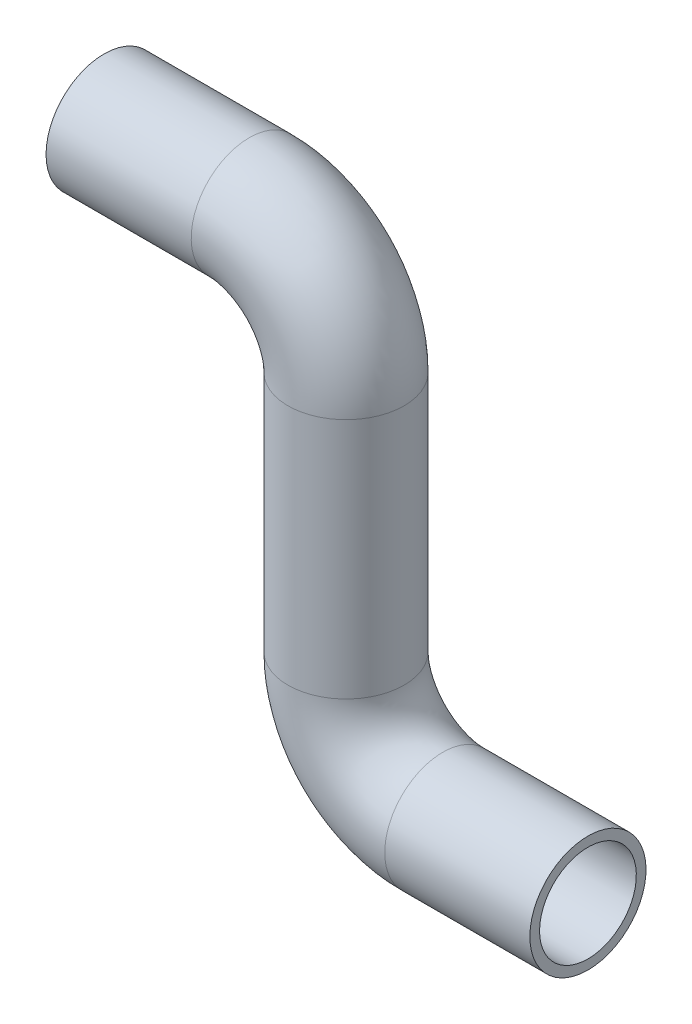
ISO-10303-21;
HEADER;
FILE_DESCRIPTION(('STEP AP214'),'2;1');
FILE_NAME('part.step','',(''),(''),'','','');
FILE_SCHEMA(('AUTOMOTIVE_DESIGN { 1 0 10303 214 1 1 1 1 }'));
ENDSEC;
DATA;
#1=APPLICATION_CONTEXT('core data for automotive mechanical design processes');
#2=APPLICATION_PROTOCOL_DEFINITION('international standard','automotive_design',2000,#1);
#3=PRODUCT_CONTEXT('',#1,'mechanical');
#4=PRODUCT('Part','Part','',(#3));
#5=PRODUCT_RELATED_PRODUCT_CATEGORY('part','',(#4));
#6=PRODUCT_DEFINITION_FORMATION('','',#4);
#7=PRODUCT_DEFINITION_CONTEXT('part definition',#1,'design');
#8=PRODUCT_DEFINITION('design','',#6,#7);
#9=PRODUCT_DEFINITION_SHAPE('','',#8);
#10=(LENGTH_UNIT() NAMED_UNIT(*) SI_UNIT(.MILLI.,.METRE.));
#11=(NAMED_UNIT(*) PLANE_ANGLE_UNIT() SI_UNIT($,.RADIAN.));
#12=(NAMED_UNIT(*) SI_UNIT($,.STERADIAN.) SOLID_ANGLE_UNIT());
#13=UNCERTAINTY_MEASURE_WITH_UNIT(LENGTH_MEASURE(1.E-05),#10,'distance_accuracy_value','');
#14=(GEOMETRIC_REPRESENTATION_CONTEXT(3) GLOBAL_UNCERTAINTY_ASSIGNED_CONTEXT((#13)) GLOBAL_UNIT_ASSIGNED_CONTEXT((#10,
#11,#12)) REPRESENTATION_CONTEXT('',''));
#15=CARTESIAN_POINT('',(0.,0.,0.));
#16=DIRECTION('',(0.,0.,1.));
#17=DIRECTION('',(1.,0.,0.));
#18=AXIS2_PLACEMENT_3D('',#15,#16,#17);
#19=CARTESIAN_POINT('',(-25.,45.,0.));
#20=DIRECTION('',(-1.,0.,0.));
#21=DIRECTION('',(0.,0.,1.));
#22=AXIS2_PLACEMENT_3D('',#19,#20,#21);
#23=PLANE('',#22);
#24=CARTESIAN_POINT('',(-25.,45.,0.));
#25=DIRECTION('',(-1.,0.,0.));
#26=DIRECTION('',(0.,0.,1.));
#27=AXIS2_PLACEMENT_3D('',#24,#25,#26);
#28=CIRCLE('',#27,5.);
#29=CARTESIAN_POINT('',(-25.,45.,5.));
#30=VERTEX_POINT('',#29);
#31=EDGE_CURVE('E223',#30,#30,#28,.T.);
#32=ORIENTED_EDGE('',*,*,#31,.F.);
#33=EDGE_LOOP('',(#32));
#34=FACE_BOUND('',#33,.T.);
#35=CARTESIAN_POINT('',(-25.,45.,0.));
#36=DIRECTION('',(-1.,0.,0.));
#37=DIRECTION('',(0.,0.,1.));
#38=AXIS2_PLACEMENT_3D('',#35,#36,#37);
#39=CIRCLE('',#38,6.);
#40=CARTESIAN_POINT('',(-25.,45.,6.));
#41=VERTEX_POINT('',#40);
#42=EDGE_CURVE('E77',#41,#41,#39,.T.);
#43=ORIENTED_EDGE('',*,*,#42,.T.);
#44=EDGE_LOOP('',(#43));
#45=FACE_BOUND('',#44,.T.);
#46=ADVANCED_FACE('F55',(#34,#45),#23,.T.);
#47=CARTESIAN_POINT('',(25.,0.,0.));
#48=DIRECTION('',(-1.,0.,0.));
#49=DIRECTION('',(0.,0.,1.));
#50=AXIS2_PLACEMENT_3D('',#47,#48,#49);
#51=PLANE('',#50);
#52=CARTESIAN_POINT('',(25.,0.,0.));
#53=DIRECTION('',(-1.,0.,0.));
#54=DIRECTION('',(0.,0.,1.));
#55=AXIS2_PLACEMENT_3D('',#52,#53,#54);
#56=CIRCLE('',#55,5.);
#57=CARTESIAN_POINT('',(25.,0.,5.));
#58=VERTEX_POINT('',#57);
#59=EDGE_CURVE('E81',#58,#58,#56,.T.);
#60=ORIENTED_EDGE('',*,*,#59,.T.);
#61=EDGE_LOOP('',(#60));
#62=FACE_BOUND('',#61,.T.);
#63=CARTESIAN_POINT('',(25.,0.,0.));
#64=DIRECTION('',(-1.,0.,0.));
#65=DIRECTION('',(0.,0.,1.));
#66=AXIS2_PLACEMENT_3D('',#63,#64,#65);
#67=CIRCLE('',#66,6.);
#68=CARTESIAN_POINT('',(25.,0.,6.));
#69=VERTEX_POINT('',#68);
#70=EDGE_CURVE('E11',#69,#69,#67,.T.);
#71=ORIENTED_EDGE('',*,*,#70,.F.);
#72=EDGE_LOOP('',(#71));
#73=FACE_BOUND('',#72,.T.);
#74=ADVANCED_FACE('F145',(#62,#73),#51,.F.);
#75=CARTESIAN_POINT('',(-25.,45.,0.));
#76=DIRECTION('',(1.,0.,0.));
#77=DIRECTION('',(0.,0.,-1.));
#78=AXIS2_PLACEMENT_3D('',#75,#76,#77);
#79=CYLINDRICAL_SURFACE('',#78,6.);
#80=CARTESIAN_POINT('',(-10.,45.,0.));
#81=DIRECTION('',(1.,0.,0.));
#82=DIRECTION('',(0.,0.,-1.));
#83=AXIS2_PLACEMENT_3D('',#80,#81,#82);
#84=CIRCLE('',#83,6.);
#85=CARTESIAN_POINT('',(-10.,51.,0.));
#86=VERTEX_POINT('',#85);
#87=EDGE_CURVE('E80',#86,#86,#84,.F.);
#88=ORIENTED_EDGE('',*,*,#87,.T.);
#89=EDGE_LOOP('',(#88));
#90=FACE_BOUND('',#89,.T.);
#91=ORIENTED_EDGE('',*,*,#42,.F.);
#92=EDGE_LOOP('',(#91));
#93=FACE_BOUND('',#92,.T.);
#94=ADVANCED_FACE('F114',(#90,#93),#79,.T.);
#95=CARTESIAN_POINT('',(-10.,35.,0.));
#96=DIRECTION('',(0.,0.,-1.));
#97=DIRECTION('',(-1.,0.,0.));
#98=AXIS2_PLACEMENT_3D('',#95,#96,#97);
#99=TOROIDAL_SURFACE('',#98,9.99999999999999,6.);
#100=CARTESIAN_POINT('',(0.,35.,0.));
#101=DIRECTION('',(0.,1.,0.));
#102=DIRECTION('',(-1.,0.,0.));
#103=AXIS2_PLACEMENT_3D('',#100,#101,#102);
#104=CIRCLE('',#103,6.);
#105=CARTESIAN_POINT('',(5.99999999999998,35.,0.));
#106=VERTEX_POINT('',#105);
#107=EDGE_CURVE('E74',#106,#106,#104,.T.);
#108=CARTESIAN_POINT('',(-10.,35.,0.));
#109=DIRECTION('',(0.,0.,-1.));
#110=DIRECTION('',(-1.,0.,0.));
#111=AXIS2_PLACEMENT_3D('',#108,#109,#110);
#112=CIRCLE('',#111,16.);
#113=EDGE_CURVE('',#86,#106,#112,.T.);
#114=ORIENTED_EDGE('',*,*,#87,.F.);
#115=ORIENTED_EDGE('',*,*,#107,.T.);
#116=ORIENTED_EDGE('',*,*,#113,.T.);
#117=ORIENTED_EDGE('',*,*,#113,.F.);
#118=EDGE_LOOP('',(#114,#116,#115,#117));
#119=FACE_BOUND('',#118,.T.);
#120=ADVANCED_FACE('F102',(#119),#99,.T.);
#121=CARTESIAN_POINT('',(0.,35.,0.));
#122=DIRECTION('',(0.,-1.,0.));
#123=DIRECTION('',(0.,0.,-1.));
#124=AXIS2_PLACEMENT_3D('',#121,#122,#123);
#125=CYLINDRICAL_SURFACE('',#124,6.);
#126=CARTESIAN_POINT('',(0.,10.0000000000001,0.));
#127=DIRECTION('',(0.,-1.,0.));
#128=DIRECTION('',(0.,0.,-1.));
#129=AXIS2_PLACEMENT_3D('',#126,#127,#128);
#130=CIRCLE('',#129,6.);
#131=CARTESIAN_POINT('',(-6.,10.0000000000001,0.));
#132=VERTEX_POINT('',#131);
#133=EDGE_CURVE('E68',#132,#132,#130,.F.);
#134=ORIENTED_EDGE('',*,*,#133,.T.);
#135=EDGE_LOOP('',(#134));
#136=FACE_BOUND('',#135,.T.);
#137=ORIENTED_EDGE('',*,*,#107,.F.);
#138=EDGE_LOOP('',(#137));
#139=FACE_BOUND('',#138,.T.);
#140=ADVANCED_FACE('F105',(#136,#139),#125,.T.);
#141=CARTESIAN_POINT('',(10.,10.,0.));
#142=DIRECTION('',(0.,0.,1.));
#143=DIRECTION('',(1.,0.,0.));
#144=AXIS2_PLACEMENT_3D('',#141,#142,#143);
#145=TOROIDAL_SURFACE('',#144,10.,6.);
#146=CARTESIAN_POINT('',(10.0000000000001,0.,0.));
#147=DIRECTION('',(-1.,0.,0.));
#148=DIRECTION('',(0.,-1.,0.));
#149=AXIS2_PLACEMENT_3D('',#146,#147,#148);
#150=CIRCLE('',#149,6.);
#151=CARTESIAN_POINT('',(10.0000000000001,-6.,0.));
#152=VERTEX_POINT('',#151);
#153=EDGE_CURVE('E63',#152,#152,#150,.T.);
#154=CARTESIAN_POINT('',(10.,10.,0.));
#155=DIRECTION('',(0.,0.,1.));
#156=DIRECTION('',(1.,0.,0.));
#157=AXIS2_PLACEMENT_3D('',#154,#155,#156);
#158=CIRCLE('',#157,16.);
#159=EDGE_CURVE('',#132,#152,#158,.T.);
#160=ORIENTED_EDGE('',*,*,#133,.F.);
#161=ORIENTED_EDGE('',*,*,#153,.T.);
#162=ORIENTED_EDGE('',*,*,#159,.T.);
#163=ORIENTED_EDGE('',*,*,#159,.F.);
#164=EDGE_LOOP('',(#160,#162,#161,#163));
#165=FACE_BOUND('',#164,.T.);
#166=ADVANCED_FACE('F107',(#165),#145,.T.);
#167=CARTESIAN_POINT('',(10.0000000000001,0.,0.));
#168=DIRECTION('',(1.,0.,0.));
#169=DIRECTION('',(0.,0.,-1.));
#170=AXIS2_PLACEMENT_3D('',#167,#168,#169);
#171=CYLINDRICAL_SURFACE('',#170,6.);
#172=ORIENTED_EDGE('',*,*,#70,.T.);
#173=EDGE_LOOP('',(#172));
#174=FACE_BOUND('',#173,.T.);
#175=ORIENTED_EDGE('',*,*,#153,.F.);
#176=EDGE_LOOP('',(#175));
#177=FACE_BOUND('',#176,.T.);
#178=ADVANCED_FACE('F57',(#174,#177),#171,.T.);
#179=CARTESIAN_POINT('',(-25.,45.,0.));
#180=DIRECTION('',(1.,0.,0.));
#181=DIRECTION('',(0.,0.,-1.));
#182=AXIS2_PLACEMENT_3D('',#179,#180,#181);
#183=CYLINDRICAL_SURFACE('',#182,5.);
#184=CARTESIAN_POINT('',(-10.,45.,0.));
#185=DIRECTION('',(-1.,0.,0.));
#186=DIRECTION('',(0.,0.,1.));
#187=AXIS2_PLACEMENT_3D('',#184,#185,#186);
#188=CIRCLE('',#187,5.);
#189=CARTESIAN_POINT('',(-10.,50.,0.));
#190=VERTEX_POINT('',#189);
#191=EDGE_CURVE('E225',#190,#190,#188,.T.);
#192=ORIENTED_EDGE('',*,*,#191,.F.);
#193=EDGE_LOOP('',(#192));
#194=FACE_BOUND('',#193,.T.);
#195=ORIENTED_EDGE('',*,*,#31,.T.);
#196=EDGE_LOOP('',(#195));
#197=FACE_BOUND('',#196,.T.);
#198=ADVANCED_FACE('F117',(#194,#197),#183,.F.);
#199=CARTESIAN_POINT('',(-10.,35.,0.));
#200=DIRECTION('',(0.,0.,-1.));
#201=DIRECTION('',(-1.,0.,0.));
#202=AXIS2_PLACEMENT_3D('',#199,#200,#201);
#203=TOROIDAL_SURFACE('',#202,9.99999999999999,5.);
#204=CARTESIAN_POINT('',(0.,35.,0.));
#205=DIRECTION('',(0.,1.,0.));
#206=DIRECTION('',(0.,0.,1.));
#207=AXIS2_PLACEMENT_3D('',#204,#205,#206);
#208=CIRCLE('',#207,5.);
#209=CARTESIAN_POINT('',(4.99999999999999,35.,0.));
#210=VERTEX_POINT('',#209);
#211=EDGE_CURVE('E229',#210,#210,#208,.T.);
#212=CARTESIAN_POINT('',(-10.,35.,0.));
#213=DIRECTION('',(0.,0.,-1.));
#214=DIRECTION('',(-1.,0.,0.));
#215=AXIS2_PLACEMENT_3D('',#212,#213,#214);
#216=CIRCLE('',#215,15.);
#217=EDGE_CURVE('',#190,#210,#216,.T.);
#218=ORIENTED_EDGE('',*,*,#191,.T.);
#219=ORIENTED_EDGE('',*,*,#211,.F.);
#220=ORIENTED_EDGE('',*,*,#217,.T.);
#221=ORIENTED_EDGE('',*,*,#217,.F.);
#222=EDGE_LOOP('',(#218,#220,#219,#221));
#223=FACE_BOUND('',#222,.T.);
#224=ADVANCED_FACE('F121',(#223),#203,.F.);
#225=CARTESIAN_POINT('',(0.,35.,0.));
#226=DIRECTION('',(0.,-1.,0.));
#227=DIRECTION('',(0.,0.,-1.));
#228=AXIS2_PLACEMENT_3D('',#225,#226,#227);
#229=CYLINDRICAL_SURFACE('',#228,5.);
#230=CARTESIAN_POINT('',(0.,10.0000000000001,0.));
#231=DIRECTION('',(0.,1.,0.));
#232=DIRECTION('',(0.,0.,1.));
#233=AXIS2_PLACEMENT_3D('',#230,#231,#232);
#234=CIRCLE('',#233,5.);
#235=CARTESIAN_POINT('',(-5.,10.0000000000001,0.));
#236=VERTEX_POINT('',#235);
#237=EDGE_CURVE('E95',#236,#236,#234,.T.);
#238=ORIENTED_EDGE('',*,*,#237,.F.);
#239=EDGE_LOOP('',(#238));
#240=FACE_BOUND('',#239,.T.);
#241=ORIENTED_EDGE('',*,*,#211,.T.);
#242=EDGE_LOOP('',(#241));
#243=FACE_BOUND('',#242,.T.);
#244=ADVANCED_FACE('F128',(#240,#243),#229,.F.);
#245=CARTESIAN_POINT('',(10.,10.,0.));
#246=DIRECTION('',(0.,0.,1.));
#247=DIRECTION('',(1.,0.,0.));
#248=AXIS2_PLACEMENT_3D('',#245,#246,#247);
#249=TOROIDAL_SURFACE('',#248,10.,5.);
#250=CARTESIAN_POINT('',(10.0000000000001,-1.73472347597681E-13,0.));
#251=DIRECTION('',(-1.,0.,0.));
#252=DIRECTION('',(0.,0.,1.));
#253=AXIS2_PLACEMENT_3D('',#250,#251,#252);
#254=CIRCLE('',#253,5.);
#255=CARTESIAN_POINT('',(10.0000000000001,-5.,0.));
#256=VERTEX_POINT('',#255);
#257=EDGE_CURVE('E89',#256,#256,#254,.T.);
#258=CARTESIAN_POINT('',(10.,10.,0.));
#259=DIRECTION('',(0.,0.,1.));
#260=DIRECTION('',(1.,0.,0.));
#261=AXIS2_PLACEMENT_3D('',#258,#259,#260);
#262=CIRCLE('',#261,15.);
#263=EDGE_CURVE('',#236,#256,#262,.T.);
#264=ORIENTED_EDGE('',*,*,#237,.T.);
#265=ORIENTED_EDGE('',*,*,#257,.F.);
#266=ORIENTED_EDGE('',*,*,#263,.T.);
#267=ORIENTED_EDGE('',*,*,#263,.F.);
#268=EDGE_LOOP('',(#264,#266,#265,#267));
#269=FACE_BOUND('',#268,.T.);
#270=ADVANCED_FACE('F136',(#269),#249,.F.);
#271=CARTESIAN_POINT('',(10.0000000000001,0.,0.));
#272=DIRECTION('',(1.,0.,0.));
#273=DIRECTION('',(0.,0.,-1.));
#274=AXIS2_PLACEMENT_3D('',#271,#272,#273);
#275=CYLINDRICAL_SURFACE('',#274,5.);
#276=ORIENTED_EDGE('',*,*,#59,.F.);
#277=EDGE_LOOP('',(#276));
#278=FACE_BOUND('',#277,.T.);
#279=ORIENTED_EDGE('',*,*,#257,.T.);
#280=EDGE_LOOP('',(#279));
#281=FACE_BOUND('',#280,.T.);
#282=ADVANCED_FACE('F140',(#278,#281),#275,.F.);
#283=CLOSED_SHELL('',(#46,#74,#94,#120,#140,#166,#178,#198,#224,#244,#270,#282));
#284=MANIFOLD_SOLID_BREP('B2',#283);
#285=ADVANCED_BREP_SHAPE_REPRESENTATION('',(#18,#284),#14);
#286=SHAPE_DEFINITION_REPRESENTATION(#9,#285);
ENDSEC;
END-ISO-10303-21;
